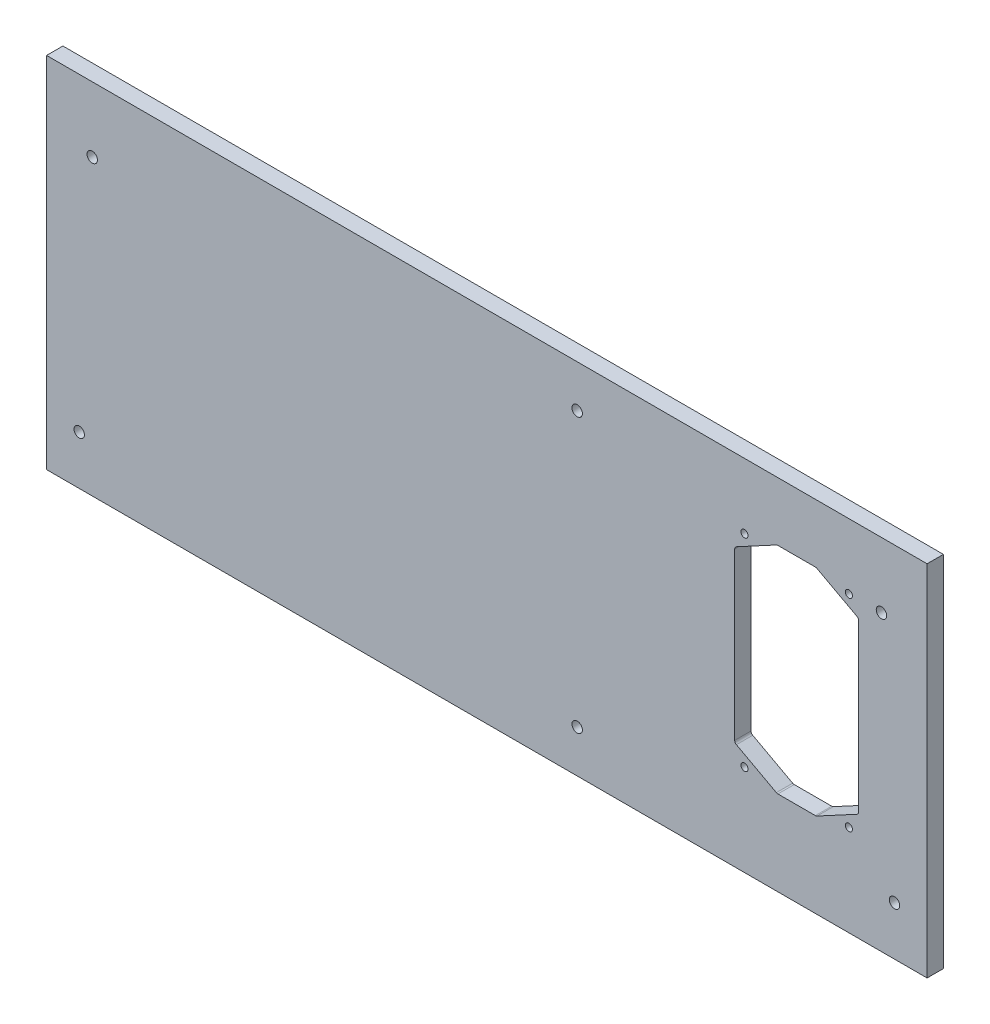
ISO-10303-21;
HEADER;
FILE_DESCRIPTION(('STEP AP214'),'2;1');
FILE_NAME('part.step','',(''),(''),'','','');
FILE_SCHEMA(('AUTOMOTIVE_DESIGN { 1 0 10303 214 1 1 1 1 }'));
ENDSEC;
DATA;
#1=APPLICATION_CONTEXT('core data for automotive mechanical design processes');
#2=APPLICATION_PROTOCOL_DEFINITION('international standard','automotive_design',2000,#1);
#3=PRODUCT_CONTEXT('',#1,'mechanical');
#4=PRODUCT('Part','Part','',(#3));
#5=PRODUCT_RELATED_PRODUCT_CATEGORY('part','',(#4));
#6=PRODUCT_DEFINITION_FORMATION('','',#4);
#7=PRODUCT_DEFINITION_CONTEXT('part definition',#1,'design');
#8=PRODUCT_DEFINITION('design','',#6,#7);
#9=PRODUCT_DEFINITION_SHAPE('','',#8);
#10=(LENGTH_UNIT() NAMED_UNIT(*) SI_UNIT(.MILLI.,.METRE.));
#11=(NAMED_UNIT(*) PLANE_ANGLE_UNIT() SI_UNIT($,.RADIAN.));
#12=(NAMED_UNIT(*) SI_UNIT($,.STERADIAN.) SOLID_ANGLE_UNIT());
#13=UNCERTAINTY_MEASURE_WITH_UNIT(LENGTH_MEASURE(1.E-05),#10,'distance_accuracy_value','');
#14=(GEOMETRIC_REPRESENTATION_CONTEXT(3) GLOBAL_UNCERTAINTY_ASSIGNED_CONTEXT((#13)) GLOBAL_UNIT_ASSIGNED_CONTEXT((#10,
#11,#12)) REPRESENTATION_CONTEXT('',''));
#15=CARTESIAN_POINT('',(0.,0.,0.));
#16=DIRECTION('',(0.,0.,1.));
#17=DIRECTION('',(1.,0.,0.));
#18=AXIS2_PLACEMENT_3D('',#15,#16,#17);
#19=CARTESIAN_POINT('',(-135.,-55.,2.5));
#20=DIRECTION('',(1.,0.,0.));
#21=DIRECTION('',(0.,0.,-1.));
#22=AXIS2_PLACEMENT_3D('',#19,#20,#21);
#23=PLANE('',#22);
#24=DIRECTION('',(0.,-1.,0.));
#25=VECTOR('',#24,1.);
#26=CARTESIAN_POINT('',(-135.,-55.,-2.5));
#27=LINE('',#26,#25);
#28=CARTESIAN_POINT('',(-135.,55.,-2.5));
#29=VERTEX_POINT('',#28);
#30=CARTESIAN_POINT('',(-135.,-55.,-2.5));
#31=VERTEX_POINT('',#30);
#32=EDGE_CURVE('E194',#29,#31,#27,.T.);
#33=ORIENTED_EDGE('',*,*,#32,.T.);
#34=DIRECTION('',(0.,0.,-1.));
#35=VECTOR('',#34,1.);
#36=CARTESIAN_POINT('',(-135.,-55.,2.5));
#37=LINE('',#36,#35);
#38=CARTESIAN_POINT('',(-135.,-55.,2.5));
#39=VERTEX_POINT('',#38);
#40=EDGE_CURVE('E175',#39,#31,#37,.T.);
#41=ORIENTED_EDGE('',*,*,#40,.F.);
#42=DIRECTION('',(0.,-1.,0.));
#43=VECTOR('',#42,1.);
#44=CARTESIAN_POINT('',(-135.,-55.,2.5));
#45=LINE('',#44,#43);
#46=CARTESIAN_POINT('',(-135.,55.,2.5));
#47=VERTEX_POINT('',#46);
#48=EDGE_CURVE('E182',#47,#39,#45,.T.);
#49=ORIENTED_EDGE('',*,*,#48,.F.);
#50=DIRECTION('',(0.,0.,-1.));
#51=VECTOR('',#50,1.);
#52=CARTESIAN_POINT('',(-135.,55.,2.5));
#53=LINE('',#52,#51);
#54=EDGE_CURVE('E321',#47,#29,#53,.T.);
#55=ORIENTED_EDGE('',*,*,#54,.T.);
#56=EDGE_LOOP('',(#33,#41,#49,#55));
#57=FACE_BOUND('',#56,.T.);
#58=ADVANCED_FACE('F33',(#57),#23,.F.);
#59=CARTESIAN_POINT('',(135.,-55.,2.5));
#60=DIRECTION('',(0.,1.,0.));
#61=DIRECTION('',(-1.,0.,0.));
#62=AXIS2_PLACEMENT_3D('',#59,#60,#61);
#63=PLANE('',#62);
#64=DIRECTION('',(1.,0.,0.));
#65=VECTOR('',#64,1.);
#66=CARTESIAN_POINT('',(135.,-55.,-2.5));
#67=LINE('',#66,#65);
#68=CARTESIAN_POINT('',(135.,-55.,-2.5));
#69=VERTEX_POINT('',#68);
#70=EDGE_CURVE('E295',#31,#69,#67,.T.);
#71=ORIENTED_EDGE('',*,*,#70,.T.);
#72=DIRECTION('',(0.,0.,-1.));
#73=VECTOR('',#72,1.);
#74=CARTESIAN_POINT('',(135.,-55.,2.5));
#75=LINE('',#74,#73);
#76=CARTESIAN_POINT('',(135.,-55.,2.5));
#77=VERTEX_POINT('',#76);
#78=EDGE_CURVE('E178',#77,#69,#75,.T.);
#79=ORIENTED_EDGE('',*,*,#78,.F.);
#80=DIRECTION('',(1.,0.,0.));
#81=VECTOR('',#80,1.);
#82=CARTESIAN_POINT('',(135.,-55.,2.5));
#83=LINE('',#82,#81);
#84=EDGE_CURVE('E171',#39,#77,#83,.T.);
#85=ORIENTED_EDGE('',*,*,#84,.F.);
#86=ORIENTED_EDGE('',*,*,#40,.T.);
#87=EDGE_LOOP('',(#71,#79,#85,#86));
#88=FACE_BOUND('',#87,.T.);
#89=ADVANCED_FACE('F173',(#88),#63,.F.);
#90=CARTESIAN_POINT('',(135.,-55.,2.5));
#91=DIRECTION('',(-1.,0.,0.));
#92=DIRECTION('',(0.,0.,1.));
#93=AXIS2_PLACEMENT_3D('',#90,#91,#92);
#94=PLANE('',#93);
#95=DIRECTION('',(0.,1.,0.));
#96=VECTOR('',#95,1.);
#97=CARTESIAN_POINT('',(135.,-55.,-2.5));
#98=LINE('',#97,#96);
#99=CARTESIAN_POINT('',(135.,55.,-2.5));
#100=VERTEX_POINT('',#99);
#101=EDGE_CURVE('E324',#69,#100,#98,.T.);
#102=ORIENTED_EDGE('',*,*,#101,.T.);
#103=DIRECTION('',(0.,0.,-1.));
#104=VECTOR('',#103,1.);
#105=CARTESIAN_POINT('',(135.,55.,2.5));
#106=LINE('',#105,#104);
#107=CARTESIAN_POINT('',(135.,55.,2.5));
#108=VERTEX_POINT('',#107);
#109=EDGE_CURVE('E199',#108,#100,#106,.T.);
#110=ORIENTED_EDGE('',*,*,#109,.F.);
#111=DIRECTION('',(0.,1.,0.));
#112=VECTOR('',#111,1.);
#113=CARTESIAN_POINT('',(135.,-55.,2.5));
#114=LINE('',#113,#112);
#115=EDGE_CURVE('E181',#77,#108,#114,.T.);
#116=ORIENTED_EDGE('',*,*,#115,.F.);
#117=ORIENTED_EDGE('',*,*,#78,.T.);
#118=EDGE_LOOP('',(#102,#110,#116,#117));
#119=FACE_BOUND('',#118,.T.);
#120=ADVANCED_FACE('F334',(#119),#94,.F.);
#121=CARTESIAN_POINT('',(135.,55.,2.5));
#122=DIRECTION('',(0.,-1.,0.));
#123=DIRECTION('',(1.,0.,0.));
#124=AXIS2_PLACEMENT_3D('',#121,#122,#123);
#125=PLANE('',#124);
#126=DIRECTION('',(-1.,0.,0.));
#127=VECTOR('',#126,1.);
#128=CARTESIAN_POINT('',(135.,55.,-2.5));
#129=LINE('',#128,#127);
#130=EDGE_CURVE('E191',#100,#29,#129,.T.);
#131=ORIENTED_EDGE('',*,*,#130,.T.);
#132=ORIENTED_EDGE('',*,*,#54,.F.);
#133=DIRECTION('',(-1.,0.,0.));
#134=VECTOR('',#133,1.);
#135=CARTESIAN_POINT('',(135.,55.,2.5));
#136=LINE('',#135,#134);
#137=EDGE_CURVE('E187',#108,#47,#136,.T.);
#138=ORIENTED_EDGE('',*,*,#137,.F.);
#139=ORIENTED_EDGE('',*,*,#109,.T.);
#140=EDGE_LOOP('',(#131,#132,#138,#139));
#141=FACE_BOUND('',#140,.T.);
#142=ADVANCED_FACE('F331',(#141),#125,.F.);
#143=CARTESIAN_POINT('',(0.,0.,2.5));
#144=DIRECTION('',(0.,0.,1.));
#145=DIRECTION('',(1.,0.,0.));
#146=AXIS2_PLACEMENT_3D('',#143,#144,#145);
#147=PLANE('',#146);
#148=CARTESIAN_POINT('',(27.7,42.,2.5));
#149=DIRECTION('',(0.,0.,-1.));
#150=DIRECTION('',(-1.,0.,0.));
#151=AXIS2_PLACEMENT_3D('',#148,#149,#150);
#152=CIRCLE('',#151,1.59999999999999);
#153=CARTESIAN_POINT('',(26.1,42.,2.5));
#154=VERTEX_POINT('',#153);
#155=EDGE_CURVE('E542',#154,#154,#152,.T.);
#156=ORIENTED_EDGE('',*,*,#155,.T.);
#157=EDGE_LOOP('',(#156));
#158=FACE_BOUND('',#157,.T.);
#159=CARTESIAN_POINT('',(27.7,-42.,2.5));
#160=DIRECTION('',(0.,0.,-1.));
#161=DIRECTION('',(-1.,0.,0.));
#162=AXIS2_PLACEMENT_3D('',#159,#160,#161);
#163=CIRCLE('',#162,1.59999999999999);
#164=CARTESIAN_POINT('',(26.1,-42.,2.5));
#165=VERTEX_POINT('',#164);
#166=EDGE_CURVE('E535',#165,#165,#163,.T.);
#167=ORIENTED_EDGE('',*,*,#166,.T.);
#168=EDGE_LOOP('',(#167));
#169=FACE_BOUND('',#168,.T.);
#170=CARTESIAN_POINT('',(121.,35.,2.5));
#171=DIRECTION('',(0.,0.,-1.));
#172=DIRECTION('',(-1.,0.,0.));
#173=AXIS2_PLACEMENT_3D('',#170,#171,#172);
#174=CIRCLE('',#173,1.59999999999999);
#175=CARTESIAN_POINT('',(119.4,35.,2.5));
#176=VERTEX_POINT('',#175);
#177=EDGE_CURVE('E528',#176,#176,#174,.T.);
#178=ORIENTED_EDGE('',*,*,#177,.T.);
#179=EDGE_LOOP('',(#178));
#180=FACE_BOUND('',#179,.T.);
#181=CARTESIAN_POINT('',(125.,-40.,2.5));
#182=DIRECTION('',(0.,0.,-1.));
#183=DIRECTION('',(-1.,0.,0.));
#184=AXIS2_PLACEMENT_3D('',#181,#182,#183);
#185=CIRCLE('',#184,1.59999999999999);
#186=CARTESIAN_POINT('',(123.4,-40.,2.5));
#187=VERTEX_POINT('',#186);
#188=EDGE_CURVE('E521',#187,#187,#185,.T.);
#189=ORIENTED_EDGE('',*,*,#188,.T.);
#190=EDGE_LOOP('',(#189));
#191=FACE_BOUND('',#190,.T.);
#192=CARTESIAN_POINT('',(-125.,-40.,2.5));
#193=DIRECTION('',(0.,0.,-1.));
#194=DIRECTION('',(-1.,0.,0.));
#195=AXIS2_PLACEMENT_3D('',#192,#193,#194);
#196=CIRCLE('',#195,1.59999999999999);
#197=CARTESIAN_POINT('',(-126.6,-40.,2.5));
#198=VERTEX_POINT('',#197);
#199=EDGE_CURVE('E514',#198,#198,#196,.T.);
#200=ORIENTED_EDGE('',*,*,#199,.T.);
#201=EDGE_LOOP('',(#200));
#202=FACE_BOUND('',#201,.T.);
#203=CARTESIAN_POINT('',(-121.,35.,2.5));
#204=DIRECTION('',(0.,0.,-1.));
#205=DIRECTION('',(-1.,0.,0.));
#206=AXIS2_PLACEMENT_3D('',#203,#204,#205);
#207=CIRCLE('',#206,1.59999999999999);
#208=CARTESIAN_POINT('',(-122.6,35.,2.5));
#209=VERTEX_POINT('',#208);
#210=EDGE_CURVE('E490',#209,#209,#207,.T.);
#211=ORIENTED_EDGE('',*,*,#210,.T.);
#212=EDGE_LOOP('',(#211));
#213=FACE_BOUND('',#212,.T.);
#214=CARTESIAN_POINT('',(79.,35.,2.5));
#215=DIRECTION('',(0.,0.,-1.));
#216=DIRECTION('',(-1.,0.,0.));
#217=AXIS2_PLACEMENT_3D('',#214,#215,#216);
#218=CIRCLE('',#217,1.10000000000004);
#219=CARTESIAN_POINT('',(77.9,35.,2.5));
#220=VERTEX_POINT('',#219);
#221=EDGE_CURVE('E305',#220,#220,#218,.T.);
#222=ORIENTED_EDGE('',*,*,#221,.T.);
#223=EDGE_LOOP('',(#222));
#224=FACE_BOUND('',#223,.T.);
#225=CARTESIAN_POINT('',(111.,35.,2.5));
#226=DIRECTION('',(0.,0.,-1.));
#227=DIRECTION('',(-1.,0.,0.));
#228=AXIS2_PLACEMENT_3D('',#225,#226,#227);
#229=CIRCLE('',#228,1.10000000000001);
#230=CARTESIAN_POINT('',(109.9,35.,2.5));
#231=VERTEX_POINT('',#230);
#232=EDGE_CURVE('E505',#231,#231,#229,.T.);
#233=ORIENTED_EDGE('',*,*,#232,.T.);
#234=EDGE_LOOP('',(#233));
#235=FACE_BOUND('',#234,.T.);
#236=CARTESIAN_POINT('',(111.,-27.,2.5));
#237=DIRECTION('',(0.,0.,-1.));
#238=DIRECTION('',(-1.,0.,0.));
#239=AXIS2_PLACEMENT_3D('',#236,#237,#238);
#240=CIRCLE('',#239,1.10000000000001);
#241=CARTESIAN_POINT('',(109.9,-27.,2.5));
#242=VERTEX_POINT('',#241);
#243=EDGE_CURVE('E501',#242,#242,#240,.T.);
#244=ORIENTED_EDGE('',*,*,#243,.T.);
#245=EDGE_LOOP('',(#244));
#246=FACE_BOUND('',#245,.T.);
#247=CARTESIAN_POINT('',(79.,-27.,2.5));
#248=DIRECTION('',(0.,0.,-1.));
#249=DIRECTION('',(-1.,0.,0.));
#250=AXIS2_PLACEMENT_3D('',#247,#248,#249);
#251=CIRCLE('',#250,1.10000000000001);
#252=CARTESIAN_POINT('',(77.9,-27.,2.5));
#253=VERTEX_POINT('',#252);
#254=EDGE_CURVE('E489',#253,#253,#251,.T.);
#255=ORIENTED_EDGE('',*,*,#254,.T.);
#256=EDGE_LOOP('',(#255));
#257=FACE_BOUND('',#256,.T.);
#258=DIRECTION('',(0.,1.,0.));
#259=VECTOR('',#258,1.);
#260=CARTESIAN_POINT('',(76.,-22.,2.5));
#261=LINE('',#260,#259);
#262=CARTESIAN_POINT('',(76.,-21.4027059184436,2.5));
#263=VERTEX_POINT('',#262);
#264=CARTESIAN_POINT('',(76.,29.4027059184436,2.5));
#265=VERTEX_POINT('',#264);
#266=EDGE_CURVE('E288',#263,#265,#261,.T.);
#267=ORIENTED_EDGE('',*,*,#266,.T.);
#268=CARTESIAN_POINT('',(77.,29.4027059184436,2.5));
#269=DIRECTION('',(0.,0.,1.));
#270=DIRECTION('',(1.,0.,0.));
#271=AXIS2_PLACEMENT_3D('',#268,#269,#270);
#272=CIRCLE('',#271,1.);
#273=CARTESIAN_POINT('',(76.525900176965,30.2831770183658,2.5));
#274=VERTEX_POINT('',#273);
#275=EDGE_CURVE('E241',#265,#274,#272,.F.);
#276=ORIENTED_EDGE('',*,*,#275,.T.);
#277=DIRECTION('',(0.880471099922175,0.474099823035017,0.));
#278=VECTOR('',#277,1.);
#279=CARTESIAN_POINT('',(76.,30.,2.5));
#280=LINE('',#279,#278);
#281=CARTESIAN_POINT('',(88.7780177569983,36.8804710999222,2.5));
#282=VERTEX_POINT('',#281);
#283=EDGE_CURVE('E318',#274,#282,#280,.T.);
#284=ORIENTED_EDGE('',*,*,#283,.T.);
#285=CARTESIAN_POINT('',(89.2521175800333,36.,2.5));
#286=DIRECTION('',(0.,0.,1.));
#287=DIRECTION('',(1.,0.,0.));
#288=AXIS2_PLACEMENT_3D('',#285,#286,#287);
#289=CIRCLE('',#288,1.);
#290=CARTESIAN_POINT('',(89.2521175800333,37.,2.5));
#291=VERTEX_POINT('',#290);
#292=EDGE_CURVE('E55',#282,#291,#289,.F.);
#293=ORIENTED_EDGE('',*,*,#292,.T.);
#294=DIRECTION('',(1.,0.,0.));
#295=VECTOR('',#294,1.);
#296=CARTESIAN_POINT('',(89.,37.,2.5));
#297=LINE('',#296,#295);
#298=CARTESIAN_POINT('',(100.747882419967,37.,2.5));
#299=VERTEX_POINT('',#298);
#300=EDGE_CURVE('E382',#291,#299,#297,.T.);
#301=ORIENTED_EDGE('',*,*,#300,.T.);
#302=CARTESIAN_POINT('',(100.747882419967,36.,2.5));
#303=DIRECTION('',(0.,0.,1.));
#304=DIRECTION('',(1.,0.,0.));
#305=AXIS2_PLACEMENT_3D('',#302,#303,#304);
#306=CIRCLE('',#305,1.);
#307=CARTESIAN_POINT('',(101.221982243002,36.8804710999222,2.5));
#308=VERTEX_POINT('',#307);
#309=EDGE_CURVE('E261',#299,#308,#306,.F.);
#310=ORIENTED_EDGE('',*,*,#309,.T.);
#311=DIRECTION('',(0.880471099922175,-0.474099823035018,0.));
#312=VECTOR('',#311,1.);
#313=CARTESIAN_POINT('',(101.,37.,2.5));
#314=LINE('',#313,#312);
#315=CARTESIAN_POINT('',(113.474099823035,30.2831770183657,2.5));
#316=VERTEX_POINT('',#315);
#317=EDGE_CURVE('E392',#308,#316,#314,.T.);
#318=ORIENTED_EDGE('',*,*,#317,.T.);
#319=CARTESIAN_POINT('',(113.,29.4027059184436,2.5));
#320=DIRECTION('',(0.,0.,1.));
#321=DIRECTION('',(1.,0.,0.));
#322=AXIS2_PLACEMENT_3D('',#319,#320,#321);
#323=CIRCLE('',#322,1.);
#324=CARTESIAN_POINT('',(114.,29.4027059184436,2.5));
#325=VERTEX_POINT('',#324);
#326=EDGE_CURVE('E257',#316,#325,#323,.F.);
#327=ORIENTED_EDGE('',*,*,#326,.T.);
#328=DIRECTION('',(0.,-1.,0.));
#329=VECTOR('',#328,1.);
#330=CARTESIAN_POINT('',(114.,-22.,2.5));
#331=LINE('',#330,#329);
#332=CARTESIAN_POINT('',(114.,-21.4027059184436,2.5));
#333=VERTEX_POINT('',#332);
#334=EDGE_CURVE('E394',#325,#333,#331,.T.);
#335=ORIENTED_EDGE('',*,*,#334,.T.);
#336=CARTESIAN_POINT('',(113.,-21.4027059184436,2.5));
#337=DIRECTION('',(0.,0.,1.));
#338=DIRECTION('',(1.,0.,0.));
#339=AXIS2_PLACEMENT_3D('',#336,#337,#338);
#340=CIRCLE('',#339,1.);
#341=CARTESIAN_POINT('',(113.474099823035,-22.2831770183658,2.5));
#342=VERTEX_POINT('',#341);
#343=EDGE_CURVE('E253',#333,#342,#340,.F.);
#344=ORIENTED_EDGE('',*,*,#343,.T.);
#345=DIRECTION('',(-0.880471099922175,-0.474099823035018,0.));
#346=VECTOR('',#345,1.);
#347=CARTESIAN_POINT('',(101.,-29.,2.5));
#348=LINE('',#347,#346);
#349=CARTESIAN_POINT('',(101.221982243002,-28.8804710999222,2.5));
#350=VERTEX_POINT('',#349);
#351=EDGE_CURVE('E397',#342,#350,#348,.T.);
#352=ORIENTED_EDGE('',*,*,#351,.T.);
#353=CARTESIAN_POINT('',(100.747882419967,-28.,2.5));
#354=DIRECTION('',(0.,0.,1.));
#355=DIRECTION('',(1.,0.,0.));
#356=AXIS2_PLACEMENT_3D('',#353,#354,#355);
#357=CIRCLE('',#356,1.);
#358=CARTESIAN_POINT('',(100.747882419967,-29.,2.5));
#359=VERTEX_POINT('',#358);
#360=EDGE_CURVE('E249',#350,#359,#357,.F.);
#361=ORIENTED_EDGE('',*,*,#360,.T.);
#362=DIRECTION('',(-1.,0.,0.));
#363=VECTOR('',#362,1.);
#364=CARTESIAN_POINT('',(89.,-29.,2.5));
#365=LINE('',#364,#363);
#366=CARTESIAN_POINT('',(89.2521175800333,-29.,2.5));
#367=VERTEX_POINT('',#366);
#368=EDGE_CURVE('E297',#359,#367,#365,.T.);
#369=ORIENTED_EDGE('',*,*,#368,.T.);
#370=CARTESIAN_POINT('',(89.2521175800333,-28.,2.5));
#371=DIRECTION('',(0.,0.,1.));
#372=DIRECTION('',(1.,0.,0.));
#373=AXIS2_PLACEMENT_3D('',#370,#371,#372);
#374=CIRCLE('',#373,1.);
#375=CARTESIAN_POINT('',(88.7780177569983,-28.8804710999222,2.5));
#376=VERTEX_POINT('',#375);
#377=EDGE_CURVE('E245',#367,#376,#374,.F.);
#378=ORIENTED_EDGE('',*,*,#377,.T.);
#379=DIRECTION('',(-0.880471099922175,0.474099823035017,0.));
#380=VECTOR('',#379,1.);
#381=CARTESIAN_POINT('',(76.,-22.,2.5));
#382=LINE('',#381,#380);
#383=CARTESIAN_POINT('',(76.525900176965,-22.2831770183658,2.5));
#384=VERTEX_POINT('',#383);
#385=EDGE_CURVE('E290',#376,#384,#382,.T.);
#386=ORIENTED_EDGE('',*,*,#385,.T.);
#387=CARTESIAN_POINT('',(77.,-21.4027059184436,2.5));
#388=DIRECTION('',(0.,0.,1.));
#389=DIRECTION('',(1.,0.,0.));
#390=AXIS2_PLACEMENT_3D('',#387,#388,#389);
#391=CIRCLE('',#390,1.);
#392=EDGE_CURVE('E11',#384,#263,#391,.F.);
#393=ORIENTED_EDGE('',*,*,#392,.T.);
#394=EDGE_LOOP('',(#267,#276,#284,#293,#301,#310,#318,#327,#335,#344,#352,#361,#369,#378,#386,#393));
#395=FACE_BOUND('',#394,.T.);
#396=ORIENTED_EDGE('',*,*,#48,.T.);
#397=ORIENTED_EDGE('',*,*,#84,.T.);
#398=ORIENTED_EDGE('',*,*,#115,.T.);
#399=ORIENTED_EDGE('',*,*,#137,.T.);
#400=EDGE_LOOP('',(#396,#397,#398,#399));
#401=FACE_BOUND('',#400,.T.);
#402=ADVANCED_FACE('F185',(#158,#169,#180,#191,#202,#213,#224,#235,#246,#257,#395,#401),#147,.T.);
#403=CARTESIAN_POINT('',(0.,0.,-2.5));
#404=DIRECTION('',(0.,0.,1.));
#405=DIRECTION('',(1.,0.,0.));
#406=AXIS2_PLACEMENT_3D('',#403,#404,#405);
#407=PLANE('',#406);
#408=CARTESIAN_POINT('',(27.7,42.,-2.5));
#409=DIRECTION('',(0.,0.,-1.));
#410=DIRECTION('',(-1.,0.,0.));
#411=AXIS2_PLACEMENT_3D('',#408,#409,#410);
#412=CIRCLE('',#411,3.25);
#413=CARTESIAN_POINT('',(24.45,42.,-2.5));
#414=VERTEX_POINT('',#413);
#415=EDGE_CURVE('E452',#414,#414,#412,.T.);
#416=ORIENTED_EDGE('',*,*,#415,.F.);
#417=EDGE_LOOP('',(#416));
#418=FACE_BOUND('',#417,.T.);
#419=CARTESIAN_POINT('',(27.7,-42.,-2.5));
#420=DIRECTION('',(0.,0.,-1.));
#421=DIRECTION('',(-1.,0.,0.));
#422=AXIS2_PLACEMENT_3D('',#419,#420,#421);
#423=CIRCLE('',#422,3.25);
#424=CARTESIAN_POINT('',(24.45,-42.,-2.5));
#425=VERTEX_POINT('',#424);
#426=EDGE_CURVE('E456',#425,#425,#423,.T.);
#427=ORIENTED_EDGE('',*,*,#426,.F.);
#428=EDGE_LOOP('',(#427));
#429=FACE_BOUND('',#428,.T.);
#430=CARTESIAN_POINT('',(121.,35.,-2.5));
#431=DIRECTION('',(0.,0.,-1.));
#432=DIRECTION('',(-1.,0.,0.));
#433=AXIS2_PLACEMENT_3D('',#430,#431,#432);
#434=CIRCLE('',#433,3.25);
#435=CARTESIAN_POINT('',(117.75,35.,-2.5));
#436=VERTEX_POINT('',#435);
#437=EDGE_CURVE('E460',#436,#436,#434,.T.);
#438=ORIENTED_EDGE('',*,*,#437,.F.);
#439=EDGE_LOOP('',(#438));
#440=FACE_BOUND('',#439,.T.);
#441=CARTESIAN_POINT('',(125.,-40.,-2.5));
#442=DIRECTION('',(0.,0.,-1.));
#443=DIRECTION('',(-1.,0.,0.));
#444=AXIS2_PLACEMENT_3D('',#441,#442,#443);
#445=CIRCLE('',#444,3.25);
#446=CARTESIAN_POINT('',(121.75,-40.,-2.5));
#447=VERTEX_POINT('',#446);
#448=EDGE_CURVE('E464',#447,#447,#445,.T.);
#449=ORIENTED_EDGE('',*,*,#448,.F.);
#450=EDGE_LOOP('',(#449));
#451=FACE_BOUND('',#450,.T.);
#452=CARTESIAN_POINT('',(-125.,-40.,-2.5));
#453=DIRECTION('',(0.,0.,-1.));
#454=DIRECTION('',(-1.,0.,0.));
#455=AXIS2_PLACEMENT_3D('',#452,#453,#454);
#456=CIRCLE('',#455,3.25);
#457=CARTESIAN_POINT('',(-128.25,-40.,-2.5));
#458=VERTEX_POINT('',#457);
#459=EDGE_CURVE('E468',#458,#458,#456,.T.);
#460=ORIENTED_EDGE('',*,*,#459,.F.);
#461=EDGE_LOOP('',(#460));
#462=FACE_BOUND('',#461,.T.);
#463=CARTESIAN_POINT('',(-121.,35.,-2.5));
#464=DIRECTION('',(0.,0.,-1.));
#465=DIRECTION('',(-1.,0.,0.));
#466=AXIS2_PLACEMENT_3D('',#463,#464,#465);
#467=CIRCLE('',#466,3.25);
#468=CARTESIAN_POINT('',(-124.25,35.,-2.5));
#469=VERTEX_POINT('',#468);
#470=EDGE_CURVE('E472',#469,#469,#467,.T.);
#471=ORIENTED_EDGE('',*,*,#470,.F.);
#472=EDGE_LOOP('',(#471));
#473=FACE_BOUND('',#472,.T.);
#474=CARTESIAN_POINT('',(79.,35.,-2.5));
#475=DIRECTION('',(0.,0.,-1.));
#476=DIRECTION('',(-1.,0.,0.));
#477=AXIS2_PLACEMENT_3D('',#474,#475,#476);
#478=CIRCLE('',#477,1.10000000000004);
#479=CARTESIAN_POINT('',(77.9,35.,-2.5));
#480=VERTEX_POINT('',#479);
#481=EDGE_CURVE('E476',#480,#480,#478,.T.);
#482=ORIENTED_EDGE('',*,*,#481,.F.);
#483=EDGE_LOOP('',(#482));
#484=FACE_BOUND('',#483,.T.);
#485=CARTESIAN_POINT('',(111.,35.,-2.5));
#486=DIRECTION('',(0.,0.,-1.));
#487=DIRECTION('',(-1.,0.,0.));
#488=AXIS2_PLACEMENT_3D('',#485,#486,#487);
#489=CIRCLE('',#488,1.10000000000001);
#490=CARTESIAN_POINT('',(109.9,35.,-2.5));
#491=VERTEX_POINT('',#490);
#492=EDGE_CURVE('E480',#491,#491,#489,.T.);
#493=ORIENTED_EDGE('',*,*,#492,.F.);
#494=EDGE_LOOP('',(#493));
#495=FACE_BOUND('',#494,.T.);
#496=CARTESIAN_POINT('',(111.,-27.,-2.5));
#497=DIRECTION('',(0.,0.,-1.));
#498=DIRECTION('',(-1.,0.,0.));
#499=AXIS2_PLACEMENT_3D('',#496,#497,#498);
#500=CIRCLE('',#499,1.10000000000001);
#501=CARTESIAN_POINT('',(109.9,-27.,-2.5));
#502=VERTEX_POINT('',#501);
#503=EDGE_CURVE('E484',#502,#502,#500,.T.);
#504=ORIENTED_EDGE('',*,*,#503,.F.);
#505=EDGE_LOOP('',(#504));
#506=FACE_BOUND('',#505,.T.);
#507=CARTESIAN_POINT('',(79.,-27.,-2.5));
#508=DIRECTION('',(0.,0.,-1.));
#509=DIRECTION('',(-1.,0.,0.));
#510=AXIS2_PLACEMENT_3D('',#507,#508,#509);
#511=CIRCLE('',#510,1.10000000000001);
#512=CARTESIAN_POINT('',(77.9,-27.,-2.5));
#513=VERTEX_POINT('',#512);
#514=EDGE_CURVE('E487',#513,#513,#511,.T.);
#515=ORIENTED_EDGE('',*,*,#514,.F.);
#516=EDGE_LOOP('',(#515));
#517=FACE_BOUND('',#516,.T.);
#518=DIRECTION('',(1.,0.,0.));
#519=VECTOR('',#518,1.);
#520=CARTESIAN_POINT('',(89.,37.,-2.5));
#521=LINE('',#520,#519);
#522=CARTESIAN_POINT('',(89.2521175800333,37.,-2.5));
#523=VERTEX_POINT('',#522);
#524=CARTESIAN_POINT('',(100.747882419967,37.,-2.5));
#525=VERTEX_POINT('',#524);
#526=EDGE_CURVE('E304',#523,#525,#521,.T.);
#527=ORIENTED_EDGE('',*,*,#526,.F.);
#528=CARTESIAN_POINT('',(89.2521175800333,36.,-2.5));
#529=DIRECTION('',(0.,0.,1.));
#530=DIRECTION('',(1.,0.,0.));
#531=AXIS2_PLACEMENT_3D('',#528,#529,#530);
#532=CIRCLE('',#531,1.);
#533=CARTESIAN_POINT('',(88.7780177569983,36.8804710999222,-2.5));
#534=VERTEX_POINT('',#533);
#535=EDGE_CURVE('E263',#523,#534,#532,.T.);
#536=ORIENTED_EDGE('',*,*,#535,.T.);
#537=DIRECTION('',(0.880471099922175,0.474099823035017,0.));
#538=VECTOR('',#537,1.);
#539=CARTESIAN_POINT('',(76.,30.,-2.5));
#540=LINE('',#539,#538);
#541=CARTESIAN_POINT('',(76.525900176965,30.2831770183658,-2.5));
#542=VERTEX_POINT('',#541);
#543=EDGE_CURVE('E301',#542,#534,#540,.T.);
#544=ORIENTED_EDGE('',*,*,#543,.F.);
#545=CARTESIAN_POINT('',(77.,29.4027059184436,-2.5));
#546=DIRECTION('',(0.,0.,1.));
#547=DIRECTION('',(1.,0.,0.));
#548=AXIS2_PLACEMENT_3D('',#545,#546,#547);
#549=CIRCLE('',#548,1.);
#550=CARTESIAN_POINT('',(76.,29.4027059184436,-2.5));
#551=VERTEX_POINT('',#550);
#552=EDGE_CURVE('E239',#542,#551,#549,.T.);
#553=ORIENTED_EDGE('',*,*,#552,.T.);
#554=DIRECTION('',(0.,1.,0.));
#555=VECTOR('',#554,1.);
#556=CARTESIAN_POINT('',(76.,-22.,-2.5));
#557=LINE('',#556,#555);
#558=CARTESIAN_POINT('',(76.,-21.4027059184436,-2.5));
#559=VERTEX_POINT('',#558);
#560=EDGE_CURVE('E274',#559,#551,#557,.T.);
#561=ORIENTED_EDGE('',*,*,#560,.F.);
#562=CARTESIAN_POINT('',(77.,-21.4027059184436,-2.5));
#563=DIRECTION('',(0.,0.,1.));
#564=DIRECTION('',(1.,0.,0.));
#565=AXIS2_PLACEMENT_3D('',#562,#563,#564);
#566=CIRCLE('',#565,1.);
#567=CARTESIAN_POINT('',(76.525900176965,-22.2831770183658,-2.5));
#568=VERTEX_POINT('',#567);
#569=EDGE_CURVE('E41',#559,#568,#566,.T.);
#570=ORIENTED_EDGE('',*,*,#569,.T.);
#571=DIRECTION('',(-0.880471099922175,0.474099823035017,0.));
#572=VECTOR('',#571,1.);
#573=CARTESIAN_POINT('',(76.,-22.,-2.5));
#574=LINE('',#573,#572);
#575=CARTESIAN_POINT('',(88.7780177569983,-28.8804710999222,-2.5));
#576=VERTEX_POINT('',#575);
#577=EDGE_CURVE('E272',#576,#568,#574,.T.);
#578=ORIENTED_EDGE('',*,*,#577,.F.);
#579=CARTESIAN_POINT('',(89.2521175800333,-28.,-2.5));
#580=DIRECTION('',(0.,0.,1.));
#581=DIRECTION('',(1.,0.,0.));
#582=AXIS2_PLACEMENT_3D('',#579,#580,#581);
#583=CIRCLE('',#582,1.);
#584=CARTESIAN_POINT('',(89.2521175800333,-29.,-2.5));
#585=VERTEX_POINT('',#584);
#586=EDGE_CURVE('E243',#576,#585,#583,.T.);
#587=ORIENTED_EDGE('',*,*,#586,.T.);
#588=DIRECTION('',(-1.,0.,0.));
#589=VECTOR('',#588,1.);
#590=CARTESIAN_POINT('',(89.,-29.,-2.5));
#591=LINE('',#590,#589);
#592=CARTESIAN_POINT('',(100.747882419967,-29.,-2.5));
#593=VERTEX_POINT('',#592);
#594=EDGE_CURVE('E283',#593,#585,#591,.T.);
#595=ORIENTED_EDGE('',*,*,#594,.F.);
#596=CARTESIAN_POINT('',(100.747882419967,-28.,-2.5));
#597=DIRECTION('',(0.,0.,1.));
#598=DIRECTION('',(1.,0.,0.));
#599=AXIS2_PLACEMENT_3D('',#596,#597,#598);
#600=CIRCLE('',#599,1.);
#601=CARTESIAN_POINT('',(101.221982243002,-28.8804710999222,-2.5));
#602=VERTEX_POINT('',#601);
#603=EDGE_CURVE('E247',#593,#602,#600,.T.);
#604=ORIENTED_EDGE('',*,*,#603,.T.);
#605=DIRECTION('',(-0.880471099922175,-0.474099823035018,0.));
#606=VECTOR('',#605,1.);
#607=CARTESIAN_POINT('',(101.,-29.,-2.5));
#608=LINE('',#607,#606);
#609=CARTESIAN_POINT('',(113.474099823035,-22.2831770183658,-2.5));
#610=VERTEX_POINT('',#609);
#611=EDGE_CURVE('E313',#610,#602,#608,.T.);
#612=ORIENTED_EDGE('',*,*,#611,.F.);
#613=CARTESIAN_POINT('',(113.,-21.4027059184436,-2.5));
#614=DIRECTION('',(0.,0.,1.));
#615=DIRECTION('',(1.,0.,0.));
#616=AXIS2_PLACEMENT_3D('',#613,#614,#615);
#617=CIRCLE('',#616,1.);
#618=CARTESIAN_POINT('',(114.,-21.4027059184436,-2.5));
#619=VERTEX_POINT('',#618);
#620=EDGE_CURVE('E251',#610,#619,#617,.T.);
#621=ORIENTED_EDGE('',*,*,#620,.T.);
#622=DIRECTION('',(0.,-1.,0.));
#623=VECTOR('',#622,1.);
#624=CARTESIAN_POINT('',(114.,-22.,-2.5));
#625=LINE('',#624,#623);
#626=CARTESIAN_POINT('',(114.,29.4027059184436,-2.5));
#627=VERTEX_POINT('',#626);
#628=EDGE_CURVE('E310',#627,#619,#625,.T.);
#629=ORIENTED_EDGE('',*,*,#628,.F.);
#630=CARTESIAN_POINT('',(113.,29.4027059184436,-2.5));
#631=DIRECTION('',(0.,0.,1.));
#632=DIRECTION('',(1.,0.,0.));
#633=AXIS2_PLACEMENT_3D('',#630,#631,#632);
#634=CIRCLE('',#633,1.);
#635=CARTESIAN_POINT('',(113.474099823035,30.2831770183657,-2.5));
#636=VERTEX_POINT('',#635);
#637=EDGE_CURVE('E255',#627,#636,#634,.T.);
#638=ORIENTED_EDGE('',*,*,#637,.T.);
#639=DIRECTION('',(0.880471099922175,-0.474099823035018,0.));
#640=VECTOR('',#639,1.);
#641=CARTESIAN_POINT('',(101.,37.,-2.5));
#642=LINE('',#641,#640);
#643=CARTESIAN_POINT('',(101.221982243002,36.8804710999222,-2.5));
#644=VERTEX_POINT('',#643);
#645=EDGE_CURVE('E307',#644,#636,#642,.T.);
#646=ORIENTED_EDGE('',*,*,#645,.F.);
#647=CARTESIAN_POINT('',(100.747882419967,36.,-2.5));
#648=DIRECTION('',(0.,0.,1.));
#649=DIRECTION('',(1.,0.,0.));
#650=AXIS2_PLACEMENT_3D('',#647,#648,#649);
#651=CIRCLE('',#650,1.);
#652=EDGE_CURVE('E259',#644,#525,#651,.T.);
#653=ORIENTED_EDGE('',*,*,#652,.T.);
#654=EDGE_LOOP('',(#527,#536,#544,#553,#561,#570,#578,#587,#595,#604,#612,#621,#629,#638,#646,#653));
#655=FACE_BOUND('',#654,.T.);
#656=ORIENTED_EDGE('',*,*,#32,.F.);
#657=ORIENTED_EDGE('',*,*,#130,.F.);
#658=ORIENTED_EDGE('',*,*,#101,.F.);
#659=ORIENTED_EDGE('',*,*,#70,.F.);
#660=EDGE_LOOP('',(#656,#657,#658,#659));
#661=FACE_BOUND('',#660,.T.);
#662=ADVANCED_FACE('F270',(#418,#429,#440,#451,#462,#473,#484,#495,#506,#517,#655,#661),#407,.F.);
#663=CARTESIAN_POINT('',(76.,30.,2.5));
#664=DIRECTION('',(-0.474099823035017,0.880471099922175,0.));
#665=DIRECTION('',(-0.880471099922175,-0.474099823035018,0.));
#666=AXIS2_PLACEMENT_3D('',#663,#664,#665);
#667=PLANE('',#666);
#668=ORIENTED_EDGE('',*,*,#283,.F.);
#669=DIRECTION('',(0.,0.,-1.));
#670=VECTOR('',#669,1.);
#671=CARTESIAN_POINT('',(76.525900176965,30.2831770183658,-2.5));
#672=LINE('',#671,#670);
#673=EDGE_CURVE('E197',#274,#542,#672,.T.);
#674=ORIENTED_EDGE('',*,*,#673,.T.);
#675=ORIENTED_EDGE('',*,*,#543,.T.);
#676=DIRECTION('',(0.,0.,-1.));
#677=VECTOR('',#676,1.);
#678=CARTESIAN_POINT('',(88.7780177569983,36.8804710999222,2.5));
#679=LINE('',#678,#677);
#680=EDGE_CURVE('E195',#534,#282,#679,.F.);
#681=ORIENTED_EDGE('',*,*,#680,.T.);
#682=EDGE_LOOP('',(#668,#674,#675,#681));
#683=FACE_BOUND('',#682,.T.);
#684=ADVANCED_FACE('F438',(#683),#667,.F.);
#685=CARTESIAN_POINT('',(76.,-22.,2.5));
#686=DIRECTION('',(-1.,0.,0.));
#687=DIRECTION('',(0.,0.,1.));
#688=AXIS2_PLACEMENT_3D('',#685,#686,#687);
#689=PLANE('',#688);
#690=ORIENTED_EDGE('',*,*,#560,.T.);
#691=DIRECTION('',(0.,0.,-1.));
#692=VECTOR('',#691,1.);
#693=CARTESIAN_POINT('',(76.,29.4027059184436,2.5));
#694=LINE('',#693,#692);
#695=EDGE_CURVE('E208',#551,#265,#694,.F.);
#696=ORIENTED_EDGE('',*,*,#695,.T.);
#697=ORIENTED_EDGE('',*,*,#266,.F.);
#698=DIRECTION('',(0.,0.,-1.));
#699=VECTOR('',#698,1.);
#700=CARTESIAN_POINT('',(76.,-21.4027059184436,-2.5));
#701=LINE('',#700,#699);
#702=EDGE_CURVE('E205',#263,#559,#701,.T.);
#703=ORIENTED_EDGE('',*,*,#702,.T.);
#704=EDGE_LOOP('',(#690,#696,#697,#703));
#705=FACE_BOUND('',#704,.T.);
#706=ADVANCED_FACE('F292',(#705),#689,.F.);
#707=CARTESIAN_POINT('',(76.,-22.,2.5));
#708=DIRECTION('',(-0.474099823035017,-0.880471099922175,0.));
#709=DIRECTION('',(0.880471099922175,-0.474099823035018,0.));
#710=AXIS2_PLACEMENT_3D('',#707,#708,#709);
#711=PLANE('',#710);
#712=ORIENTED_EDGE('',*,*,#385,.F.);
#713=DIRECTION('',(0.,0.,-1.));
#714=VECTOR('',#713,1.);
#715=CARTESIAN_POINT('',(88.7780177569983,-28.8804710999222,-2.5));
#716=LINE('',#715,#714);
#717=EDGE_CURVE('E212',#376,#576,#716,.T.);
#718=ORIENTED_EDGE('',*,*,#717,.T.);
#719=ORIENTED_EDGE('',*,*,#577,.T.);
#720=DIRECTION('',(0.,0.,-1.));
#721=VECTOR('',#720,1.);
#722=CARTESIAN_POINT('',(76.525900176965,-22.2831770183658,2.5));
#723=LINE('',#722,#721);
#724=EDGE_CURVE('E210',#568,#384,#723,.F.);
#725=ORIENTED_EDGE('',*,*,#724,.T.);
#726=EDGE_LOOP('',(#712,#718,#719,#725));
#727=FACE_BOUND('',#726,.T.);
#728=ADVANCED_FACE('F280',(#727),#711,.F.);
#729=CARTESIAN_POINT('',(89.,-29.,2.5));
#730=DIRECTION('',(0.,-1.,0.));
#731=DIRECTION('',(1.,0.,0.));
#732=AXIS2_PLACEMENT_3D('',#729,#730,#731);
#733=PLANE('',#732);
#734=ORIENTED_EDGE('',*,*,#594,.T.);
#735=DIRECTION('',(0.,0.,-1.));
#736=VECTOR('',#735,1.);
#737=CARTESIAN_POINT('',(89.2521175800333,-29.,2.5));
#738=LINE('',#737,#736);
#739=EDGE_CURVE('E218',#585,#367,#738,.F.);
#740=ORIENTED_EDGE('',*,*,#739,.T.);
#741=ORIENTED_EDGE('',*,*,#368,.F.);
#742=DIRECTION('',(0.,0.,-1.));
#743=VECTOR('',#742,1.);
#744=CARTESIAN_POINT('',(100.747882419967,-29.,-2.5));
#745=LINE('',#744,#743);
#746=EDGE_CURVE('E215',#359,#593,#745,.T.);
#747=ORIENTED_EDGE('',*,*,#746,.T.);
#748=EDGE_LOOP('',(#734,#740,#741,#747));
#749=FACE_BOUND('',#748,.T.);
#750=ADVANCED_FACE('F411',(#749),#733,.F.);
#751=CARTESIAN_POINT('',(101.,-29.,2.5));
#752=DIRECTION('',(0.474099823035018,-0.880471099922175,0.));
#753=DIRECTION('',(0.880471099922175,0.474099823035018,0.));
#754=AXIS2_PLACEMENT_3D('',#751,#752,#753);
#755=PLANE('',#754);
#756=ORIENTED_EDGE('',*,*,#611,.T.);
#757=DIRECTION('',(0.,0.,-1.));
#758=VECTOR('',#757,1.);
#759=CARTESIAN_POINT('',(101.221982243002,-28.8804710999222,2.5));
#760=LINE('',#759,#758);
#761=EDGE_CURVE('E223',#602,#350,#760,.F.);
#762=ORIENTED_EDGE('',*,*,#761,.T.);
#763=ORIENTED_EDGE('',*,*,#351,.F.);
#764=DIRECTION('',(0.,0.,-1.));
#765=VECTOR('',#764,1.);
#766=CARTESIAN_POINT('',(113.474099823035,-22.2831770183658,-2.5));
#767=LINE('',#766,#765);
#768=EDGE_CURVE('E220',#342,#610,#767,.T.);
#769=ORIENTED_EDGE('',*,*,#768,.T.);
#770=EDGE_LOOP('',(#756,#762,#763,#769));
#771=FACE_BOUND('',#770,.T.);
#772=ADVANCED_FACE('F415',(#771),#755,.F.);
#773=CARTESIAN_POINT('',(114.,-22.,2.5));
#774=DIRECTION('',(1.,0.,0.));
#775=DIRECTION('',(0.,0.,-1.));
#776=AXIS2_PLACEMENT_3D('',#773,#774,#775);
#777=PLANE('',#776);
#778=ORIENTED_EDGE('',*,*,#628,.T.);
#779=DIRECTION('',(0.,0.,-1.));
#780=VECTOR('',#779,1.);
#781=CARTESIAN_POINT('',(114.,-21.4027059184436,2.5));
#782=LINE('',#781,#780);
#783=EDGE_CURVE('E228',#619,#333,#782,.F.);
#784=ORIENTED_EDGE('',*,*,#783,.T.);
#785=ORIENTED_EDGE('',*,*,#334,.F.);
#786=DIRECTION('',(0.,0.,-1.));
#787=VECTOR('',#786,1.);
#788=CARTESIAN_POINT('',(114.,29.4027059184436,-2.5));
#789=LINE('',#788,#787);
#790=EDGE_CURVE('E225',#325,#627,#789,.T.);
#791=ORIENTED_EDGE('',*,*,#790,.T.);
#792=EDGE_LOOP('',(#778,#784,#785,#791));
#793=FACE_BOUND('',#792,.T.);
#794=ADVANCED_FACE('F422',(#793),#777,.F.);
#795=CARTESIAN_POINT('',(101.,37.,2.5));
#796=DIRECTION('',(0.474099823035018,0.880471099922175,0.));
#797=DIRECTION('',(-0.880471099922175,0.474099823035018,0.));
#798=AXIS2_PLACEMENT_3D('',#795,#796,#797);
#799=PLANE('',#798);
#800=ORIENTED_EDGE('',*,*,#645,.T.);
#801=DIRECTION('',(0.,0.,-1.));
#802=VECTOR('',#801,1.);
#803=CARTESIAN_POINT('',(113.474099823035,30.2831770183657,2.5));
#804=LINE('',#803,#802);
#805=EDGE_CURVE('E233',#636,#316,#804,.F.);
#806=ORIENTED_EDGE('',*,*,#805,.T.);
#807=ORIENTED_EDGE('',*,*,#317,.F.);
#808=DIRECTION('',(0.,0.,-1.));
#809=VECTOR('',#808,1.);
#810=CARTESIAN_POINT('',(101.221982243002,36.8804710999222,-2.5));
#811=LINE('',#810,#809);
#812=EDGE_CURVE('E230',#308,#644,#811,.T.);
#813=ORIENTED_EDGE('',*,*,#812,.T.);
#814=EDGE_LOOP('',(#800,#806,#807,#813));
#815=FACE_BOUND('',#814,.T.);
#816=ADVANCED_FACE('F389',(#815),#799,.F.);
#817=CARTESIAN_POINT('',(89.,37.,2.5));
#818=DIRECTION('',(0.,1.,0.));
#819=DIRECTION('',(0.,0.,1.));
#820=AXIS2_PLACEMENT_3D('',#817,#818,#819);
#821=PLANE('',#820);
#822=ORIENTED_EDGE('',*,*,#526,.T.);
#823=DIRECTION('',(0.,0.,-1.));
#824=VECTOR('',#823,1.);
#825=CARTESIAN_POINT('',(100.747882419967,37.,2.5));
#826=LINE('',#825,#824);
#827=EDGE_CURVE('E48',#525,#299,#826,.F.);
#828=ORIENTED_EDGE('',*,*,#827,.T.);
#829=ORIENTED_EDGE('',*,*,#300,.F.);
#830=DIRECTION('',(0.,0.,-1.));
#831=VECTOR('',#830,1.);
#832=CARTESIAN_POINT('',(89.2521175800333,37.,-2.5));
#833=LINE('',#832,#831);
#834=EDGE_CURVE('E235',#291,#523,#833,.T.);
#835=ORIENTED_EDGE('',*,*,#834,.T.);
#836=EDGE_LOOP('',(#822,#828,#829,#835));
#837=FACE_BOUND('',#836,.T.);
#838=ADVANCED_FACE('F381',(#837),#821,.F.);
#839=CARTESIAN_POINT('',(79.,-27.,2.5));
#840=DIRECTION('',(0.,0.,-1.));
#841=DIRECTION('',(-1.,0.,0.));
#842=AXIS2_PLACEMENT_3D('',#839,#840,#841);
#843=CYLINDRICAL_SURFACE('',#842,1.10000000000001);
#844=ORIENTED_EDGE('',*,*,#254,.F.);
#845=EDGE_LOOP('',(#844));
#846=FACE_BOUND('',#845,.T.);
#847=ORIENTED_EDGE('',*,*,#514,.T.);
#848=EDGE_LOOP('',(#847));
#849=FACE_BOUND('',#848,.T.);
#850=ADVANCED_FACE('F437',(#846,#849),#843,.F.);
#851=CARTESIAN_POINT('',(111.,-27.,2.5));
#852=DIRECTION('',(0.,0.,-1.));
#853=DIRECTION('',(-1.,0.,0.));
#854=AXIS2_PLACEMENT_3D('',#851,#852,#853);
#855=CYLINDRICAL_SURFACE('',#854,1.10000000000001);
#856=ORIENTED_EDGE('',*,*,#243,.F.);
#857=EDGE_LOOP('',(#856));
#858=FACE_BOUND('',#857,.T.);
#859=ORIENTED_EDGE('',*,*,#503,.T.);
#860=EDGE_LOOP('',(#859));
#861=FACE_BOUND('',#860,.T.);
#862=ADVANCED_FACE('F606',(#858,#861),#855,.F.);
#863=CARTESIAN_POINT('',(111.,35.,2.5));
#864=DIRECTION('',(0.,0.,-1.));
#865=DIRECTION('',(-1.,0.,0.));
#866=AXIS2_PLACEMENT_3D('',#863,#864,#865);
#867=CYLINDRICAL_SURFACE('',#866,1.10000000000001);
#868=ORIENTED_EDGE('',*,*,#232,.F.);
#869=EDGE_LOOP('',(#868));
#870=FACE_BOUND('',#869,.T.);
#871=ORIENTED_EDGE('',*,*,#492,.T.);
#872=EDGE_LOOP('',(#871));
#873=FACE_BOUND('',#872,.T.);
#874=ADVANCED_FACE('F602',(#870,#873),#867,.F.);
#875=CARTESIAN_POINT('',(79.,35.,2.5));
#876=DIRECTION('',(0.,0.,-1.));
#877=DIRECTION('',(-1.,0.,0.));
#878=AXIS2_PLACEMENT_3D('',#875,#876,#877);
#879=CYLINDRICAL_SURFACE('',#878,1.10000000000004);
#880=ORIENTED_EDGE('',*,*,#221,.F.);
#881=EDGE_LOOP('',(#880));
#882=FACE_BOUND('',#881,.T.);
#883=ORIENTED_EDGE('',*,*,#481,.T.);
#884=EDGE_LOOP('',(#883));
#885=FACE_BOUND('',#884,.T.);
#886=ADVANCED_FACE('F352',(#882,#885),#879,.F.);
#887=CARTESIAN_POINT('',(77.,29.4027059184436,2.5));
#888=DIRECTION('',(0.,0.,1.));
#889=DIRECTION('',(1.,0.,0.));
#890=AXIS2_PLACEMENT_3D('',#887,#888,#889);
#891=CYLINDRICAL_SURFACE('',#890,1.);
#892=ORIENTED_EDGE('',*,*,#275,.F.);
#893=ORIENTED_EDGE('',*,*,#695,.F.);
#894=ORIENTED_EDGE('',*,*,#552,.F.);
#895=ORIENTED_EDGE('',*,*,#673,.F.);
#896=EDGE_LOOP('',(#892,#893,#894,#895));
#897=FACE_BOUND('',#896,.T.);
#898=ADVANCED_FACE('F348',(#897),#891,.F.);
#899=CARTESIAN_POINT('',(89.2521175800333,-28.,2.5));
#900=DIRECTION('',(0.,0.,1.));
#901=DIRECTION('',(1.,0.,0.));
#902=AXIS2_PLACEMENT_3D('',#899,#900,#901);
#903=CYLINDRICAL_SURFACE('',#902,1.);
#904=ORIENTED_EDGE('',*,*,#377,.F.);
#905=ORIENTED_EDGE('',*,*,#739,.F.);
#906=ORIENTED_EDGE('',*,*,#586,.F.);
#907=ORIENTED_EDGE('',*,*,#717,.F.);
#908=EDGE_LOOP('',(#904,#905,#906,#907));
#909=FACE_BOUND('',#908,.T.);
#910=ADVANCED_FACE('F351',(#909),#903,.F.);
#911=CARTESIAN_POINT('',(100.747882419967,-28.,2.5));
#912=DIRECTION('',(0.,0.,1.));
#913=DIRECTION('',(1.,0.,0.));
#914=AXIS2_PLACEMENT_3D('',#911,#912,#913);
#915=CYLINDRICAL_SURFACE('',#914,1.);
#916=ORIENTED_EDGE('',*,*,#360,.F.);
#917=ORIENTED_EDGE('',*,*,#761,.F.);
#918=ORIENTED_EDGE('',*,*,#603,.F.);
#919=ORIENTED_EDGE('',*,*,#746,.F.);
#920=EDGE_LOOP('',(#916,#917,#918,#919));
#921=FACE_BOUND('',#920,.T.);
#922=ADVANCED_FACE('F356',(#921),#915,.F.);
#923=CARTESIAN_POINT('',(113.,-21.4027059184436,2.5));
#924=DIRECTION('',(0.,0.,1.));
#925=DIRECTION('',(1.,0.,0.));
#926=AXIS2_PLACEMENT_3D('',#923,#924,#925);
#927=CYLINDRICAL_SURFACE('',#926,1.);
#928=ORIENTED_EDGE('',*,*,#343,.F.);
#929=ORIENTED_EDGE('',*,*,#783,.F.);
#930=ORIENTED_EDGE('',*,*,#620,.F.);
#931=ORIENTED_EDGE('',*,*,#768,.F.);
#932=EDGE_LOOP('',(#928,#929,#930,#931));
#933=FACE_BOUND('',#932,.T.);
#934=ADVANCED_FACE('F360',(#933),#927,.F.);
#935=CARTESIAN_POINT('',(113.,29.4027059184436,2.5));
#936=DIRECTION('',(0.,0.,1.));
#937=DIRECTION('',(1.,0.,0.));
#938=AXIS2_PLACEMENT_3D('',#935,#936,#937);
#939=CYLINDRICAL_SURFACE('',#938,1.);
#940=ORIENTED_EDGE('',*,*,#326,.F.);
#941=ORIENTED_EDGE('',*,*,#805,.F.);
#942=ORIENTED_EDGE('',*,*,#637,.F.);
#943=ORIENTED_EDGE('',*,*,#790,.F.);
#944=EDGE_LOOP('',(#940,#941,#942,#943));
#945=FACE_BOUND('',#944,.T.);
#946=ADVANCED_FACE('F364',(#945),#939,.F.);
#947=CARTESIAN_POINT('',(100.747882419967,36.,2.5));
#948=DIRECTION('',(0.,0.,1.));
#949=DIRECTION('',(1.,0.,0.));
#950=AXIS2_PLACEMENT_3D('',#947,#948,#949);
#951=CYLINDRICAL_SURFACE('',#950,1.);
#952=ORIENTED_EDGE('',*,*,#309,.F.);
#953=ORIENTED_EDGE('',*,*,#827,.F.);
#954=ORIENTED_EDGE('',*,*,#652,.F.);
#955=ORIENTED_EDGE('',*,*,#812,.F.);
#956=EDGE_LOOP('',(#952,#953,#954,#955));
#957=FACE_BOUND('',#956,.T.);
#958=ADVANCED_FACE('F368',(#957),#951,.F.);
#959=CARTESIAN_POINT('',(89.2521175800333,36.,2.5));
#960=DIRECTION('',(0.,0.,1.));
#961=DIRECTION('',(1.,0.,0.));
#962=AXIS2_PLACEMENT_3D('',#959,#960,#961);
#963=CYLINDRICAL_SURFACE('',#962,1.);
#964=ORIENTED_EDGE('',*,*,#292,.F.);
#965=ORIENTED_EDGE('',*,*,#680,.F.);
#966=ORIENTED_EDGE('',*,*,#535,.F.);
#967=ORIENTED_EDGE('',*,*,#834,.F.);
#968=EDGE_LOOP('',(#964,#965,#966,#967));
#969=FACE_BOUND('',#968,.T.);
#970=ADVANCED_FACE('F371',(#969),#963,.F.);
#971=CARTESIAN_POINT('',(77.,-21.4027059184436,2.5));
#972=DIRECTION('',(0.,0.,1.));
#973=DIRECTION('',(1.,0.,0.));
#974=AXIS2_PLACEMENT_3D('',#971,#972,#973);
#975=CYLINDRICAL_SURFACE('',#974,1.);
#976=ORIENTED_EDGE('',*,*,#392,.F.);
#977=ORIENTED_EDGE('',*,*,#724,.F.);
#978=ORIENTED_EDGE('',*,*,#569,.F.);
#979=ORIENTED_EDGE('',*,*,#702,.F.);
#980=EDGE_LOOP('',(#976,#977,#978,#979));
#981=FACE_BOUND('',#980,.T.);
#982=ADVANCED_FACE('F35',(#981),#975,.F.);
#983=CARTESIAN_POINT('',(-121.,35.,-2.5));
#984=DIRECTION('',(0.,0.,-1.));
#985=DIRECTION('',(-1.,0.,0.));
#986=AXIS2_PLACEMENT_3D('',#983,#984,#985);
#987=CYLINDRICAL_SURFACE('',#986,1.59999999999999);
#988=ORIENTED_EDGE('',*,*,#210,.F.);
#989=EDGE_LOOP('',(#988));
#990=FACE_BOUND('',#989,.T.);
#991=CARTESIAN_POINT('',(-121.,35.,-0.850000000000001));
#992=DIRECTION('',(0.,0.,-1.));
#993=DIRECTION('',(-1.,0.,0.));
#994=AXIS2_PLACEMENT_3D('',#991,#992,#993);
#995=CIRCLE('',#994,1.59999999999999);
#996=CARTESIAN_POINT('',(-122.6,35.,-0.850000000000001));
#997=VERTEX_POINT('',#996);
#998=EDGE_CURVE('E495',#997,#997,#995,.T.);
#999=ORIENTED_EDGE('',*,*,#998,.T.);
#1000=EDGE_LOOP('',(#999));
#1001=FACE_BOUND('',#1000,.T.);
#1002=ADVANCED_FACE('F378',(#990,#1001),#987,.F.);
#1003=CARTESIAN_POINT('',(-121.,35.,-2.5));
#1004=DIRECTION('',(0.,0.,-1.));
#1005=DIRECTION('',(-1.,0.,0.));
#1006=AXIS2_PLACEMENT_3D('',#1003,#1004,#1005);
#1007=CONICAL_SURFACE('',#1006,3.25,0.785398163397452);
#1008=ORIENTED_EDGE('',*,*,#998,.F.);
#1009=EDGE_LOOP('',(#1008));
#1010=FACE_BOUND('',#1009,.T.);
#1011=ORIENTED_EDGE('',*,*,#470,.T.);
#1012=EDGE_LOOP('',(#1011));
#1013=FACE_BOUND('',#1012,.T.);
#1014=ADVANCED_FACE('F592',(#1010,#1013),#1007,.F.);
#1015=CARTESIAN_POINT('',(-125.,-40.,-2.5));
#1016=DIRECTION('',(0.,0.,-1.));
#1017=DIRECTION('',(-1.,0.,0.));
#1018=AXIS2_PLACEMENT_3D('',#1015,#1016,#1017);
#1019=CYLINDRICAL_SURFACE('',#1018,1.59999999999999);
#1020=ORIENTED_EDGE('',*,*,#199,.F.);
#1021=EDGE_LOOP('',(#1020));
#1022=FACE_BOUND('',#1021,.T.);
#1023=CARTESIAN_POINT('',(-125.,-40.,-0.850000000000001));
#1024=DIRECTION('',(0.,0.,-1.));
#1025=DIRECTION('',(-1.,0.,0.));
#1026=AXIS2_PLACEMENT_3D('',#1023,#1024,#1025);
#1027=CIRCLE('',#1026,1.59999999999999);
#1028=CARTESIAN_POINT('',(-126.6,-40.,-0.850000000000001));
#1029=VERTEX_POINT('',#1028);
#1030=EDGE_CURVE('E517',#1029,#1029,#1027,.T.);
#1031=ORIENTED_EDGE('',*,*,#1030,.T.);
#1032=EDGE_LOOP('',(#1031));
#1033=FACE_BOUND('',#1032,.T.);
#1034=ADVANCED_FACE('F588',(#1022,#1033),#1019,.F.);
#1035=CARTESIAN_POINT('',(-125.,-40.,-2.5));
#1036=DIRECTION('',(0.,0.,-1.));
#1037=DIRECTION('',(-1.,0.,0.));
#1038=AXIS2_PLACEMENT_3D('',#1035,#1036,#1037);
#1039=CONICAL_SURFACE('',#1038,3.25,0.785398163397452);
#1040=ORIENTED_EDGE('',*,*,#1030,.F.);
#1041=EDGE_LOOP('',(#1040));
#1042=FACE_BOUND('',#1041,.T.);
#1043=ORIENTED_EDGE('',*,*,#459,.T.);
#1044=EDGE_LOOP('',(#1043));
#1045=FACE_BOUND('',#1044,.T.);
#1046=ADVANCED_FACE('F584',(#1042,#1045),#1039,.F.);
#1047=CARTESIAN_POINT('',(125.,-40.,-2.5));
#1048=DIRECTION('',(0.,0.,-1.));
#1049=DIRECTION('',(-1.,0.,0.));
#1050=AXIS2_PLACEMENT_3D('',#1047,#1048,#1049);
#1051=CYLINDRICAL_SURFACE('',#1050,1.59999999999999);
#1052=ORIENTED_EDGE('',*,*,#188,.F.);
#1053=EDGE_LOOP('',(#1052));
#1054=FACE_BOUND('',#1053,.T.);
#1055=CARTESIAN_POINT('',(125.,-40.,-0.850000000000001));
#1056=DIRECTION('',(0.,0.,-1.));
#1057=DIRECTION('',(-1.,0.,0.));
#1058=AXIS2_PLACEMENT_3D('',#1055,#1056,#1057);
#1059=CIRCLE('',#1058,1.59999999999999);
#1060=CARTESIAN_POINT('',(123.4,-40.,-0.850000000000001));
#1061=VERTEX_POINT('',#1060);
#1062=EDGE_CURVE('E524',#1061,#1061,#1059,.T.);
#1063=ORIENTED_EDGE('',*,*,#1062,.T.);
#1064=EDGE_LOOP('',(#1063));
#1065=FACE_BOUND('',#1064,.T.);
#1066=ADVANCED_FACE('F580',(#1054,#1065),#1051,.F.);
#1067=CARTESIAN_POINT('',(125.,-40.,-2.5));
#1068=DIRECTION('',(0.,0.,-1.));
#1069=DIRECTION('',(-1.,0.,0.));
#1070=AXIS2_PLACEMENT_3D('',#1067,#1068,#1069);
#1071=CONICAL_SURFACE('',#1070,3.25,0.785398163397452);
#1072=ORIENTED_EDGE('',*,*,#1062,.F.);
#1073=EDGE_LOOP('',(#1072));
#1074=FACE_BOUND('',#1073,.T.);
#1075=ORIENTED_EDGE('',*,*,#448,.T.);
#1076=EDGE_LOOP('',(#1075));
#1077=FACE_BOUND('',#1076,.T.);
#1078=ADVANCED_FACE('F576',(#1074,#1077),#1071,.F.);
#1079=CARTESIAN_POINT('',(121.,35.,-2.5));
#1080=DIRECTION('',(0.,0.,-1.));
#1081=DIRECTION('',(-1.,0.,0.));
#1082=AXIS2_PLACEMENT_3D('',#1079,#1080,#1081);
#1083=CYLINDRICAL_SURFACE('',#1082,1.59999999999999);
#1084=ORIENTED_EDGE('',*,*,#177,.F.);
#1085=EDGE_LOOP('',(#1084));
#1086=FACE_BOUND('',#1085,.T.);
#1087=CARTESIAN_POINT('',(121.,35.,-0.850000000000001));
#1088=DIRECTION('',(0.,0.,-1.));
#1089=DIRECTION('',(-1.,0.,0.));
#1090=AXIS2_PLACEMENT_3D('',#1087,#1088,#1089);
#1091=CIRCLE('',#1090,1.59999999999999);
#1092=CARTESIAN_POINT('',(119.4,35.,-0.850000000000001));
#1093=VERTEX_POINT('',#1092);
#1094=EDGE_CURVE('E531',#1093,#1093,#1091,.T.);
#1095=ORIENTED_EDGE('',*,*,#1094,.T.);
#1096=EDGE_LOOP('',(#1095));
#1097=FACE_BOUND('',#1096,.T.);
#1098=ADVANCED_FACE('F572',(#1086,#1097),#1083,.F.);
#1099=CARTESIAN_POINT('',(121.,35.,-2.5));
#1100=DIRECTION('',(0.,0.,-1.));
#1101=DIRECTION('',(-1.,0.,0.));
#1102=AXIS2_PLACEMENT_3D('',#1099,#1100,#1101);
#1103=CONICAL_SURFACE('',#1102,3.25,0.785398163397452);
#1104=ORIENTED_EDGE('',*,*,#1094,.F.);
#1105=EDGE_LOOP('',(#1104));
#1106=FACE_BOUND('',#1105,.T.);
#1107=ORIENTED_EDGE('',*,*,#437,.T.);
#1108=EDGE_LOOP('',(#1107));
#1109=FACE_BOUND('',#1108,.T.);
#1110=ADVANCED_FACE('F568',(#1106,#1109),#1103,.F.);
#1111=CARTESIAN_POINT('',(27.7,-42.,-2.5));
#1112=DIRECTION('',(0.,0.,-1.));
#1113=DIRECTION('',(-1.,0.,0.));
#1114=AXIS2_PLACEMENT_3D('',#1111,#1112,#1113);
#1115=CYLINDRICAL_SURFACE('',#1114,1.59999999999999);
#1116=ORIENTED_EDGE('',*,*,#166,.F.);
#1117=EDGE_LOOP('',(#1116));
#1118=FACE_BOUND('',#1117,.T.);
#1119=CARTESIAN_POINT('',(27.7,-42.,-0.850000000000001));
#1120=DIRECTION('',(0.,0.,-1.));
#1121=DIRECTION('',(-1.,0.,0.));
#1122=AXIS2_PLACEMENT_3D('',#1119,#1120,#1121);
#1123=CIRCLE('',#1122,1.59999999999999);
#1124=CARTESIAN_POINT('',(26.1,-42.,-0.850000000000001));
#1125=VERTEX_POINT('',#1124);
#1126=EDGE_CURVE('E538',#1125,#1125,#1123,.T.);
#1127=ORIENTED_EDGE('',*,*,#1126,.T.);
#1128=EDGE_LOOP('',(#1127));
#1129=FACE_BOUND('',#1128,.T.);
#1130=ADVANCED_FACE('F564',(#1118,#1129),#1115,.F.);
#1131=CARTESIAN_POINT('',(27.7,-42.,-2.5));
#1132=DIRECTION('',(0.,0.,-1.));
#1133=DIRECTION('',(-1.,0.,0.));
#1134=AXIS2_PLACEMENT_3D('',#1131,#1132,#1133);
#1135=CONICAL_SURFACE('',#1134,3.25,0.785398163397452);
#1136=ORIENTED_EDGE('',*,*,#1126,.F.);
#1137=EDGE_LOOP('',(#1136));
#1138=FACE_BOUND('',#1137,.T.);
#1139=ORIENTED_EDGE('',*,*,#426,.T.);
#1140=EDGE_LOOP('',(#1139));
#1141=FACE_BOUND('',#1140,.T.);
#1142=ADVANCED_FACE('F557',(#1138,#1141),#1135,.F.);
#1143=CARTESIAN_POINT('',(27.7,42.,-2.5));
#1144=DIRECTION('',(0.,0.,-1.));
#1145=DIRECTION('',(-1.,0.,0.));
#1146=AXIS2_PLACEMENT_3D('',#1143,#1144,#1145);
#1147=CYLINDRICAL_SURFACE('',#1146,1.59999999999999);
#1148=ORIENTED_EDGE('',*,*,#155,.F.);
#1149=EDGE_LOOP('',(#1148));
#1150=FACE_BOUND('',#1149,.T.);
#1151=CARTESIAN_POINT('',(27.7,42.,-0.850000000000001));
#1152=DIRECTION('',(0.,0.,-1.));
#1153=DIRECTION('',(-1.,0.,0.));
#1154=AXIS2_PLACEMENT_3D('',#1151,#1152,#1153);
#1155=CIRCLE('',#1154,1.59999999999999);
#1156=CARTESIAN_POINT('',(26.1,42.,-0.850000000000001));
#1157=VERTEX_POINT('',#1156);
#1158=EDGE_CURVE('E545',#1157,#1157,#1155,.T.);
#1159=ORIENTED_EDGE('',*,*,#1158,.T.);
#1160=EDGE_LOOP('',(#1159));
#1161=FACE_BOUND('',#1160,.T.);
#1162=ADVANCED_FACE('F551',(#1150,#1161),#1147,.F.);
#1163=CARTESIAN_POINT('',(27.7,42.,-2.5));
#1164=DIRECTION('',(0.,0.,-1.));
#1165=DIRECTION('',(-1.,0.,0.));
#1166=AXIS2_PLACEMENT_3D('',#1163,#1164,#1165);
#1167=CONICAL_SURFACE('',#1166,3.25,0.785398163397452);
#1168=ORIENTED_EDGE('',*,*,#1158,.F.);
#1169=EDGE_LOOP('',(#1168));
#1170=FACE_BOUND('',#1169,.T.);
#1171=ORIENTED_EDGE('',*,*,#415,.T.);
#1172=EDGE_LOOP('',(#1171));
#1173=FACE_BOUND('',#1172,.T.);
#1174=ADVANCED_FACE('F549',(#1170,#1173),#1167,.F.);
#1175=CLOSED_SHELL('',(#58,#89,#120,#142,#402,#662,#684,#706,#728,#750,#772,#794,#816,#838,#850,
#862,#874,#886,#898,#910,#922,#934,#946,#958,#970,#982,#1002,#1014,#1034,#1046,#1066,#1078,
#1098,#1110,#1130,#1142,#1162,#1174));
#1176=MANIFOLD_SOLID_BREP('B2',#1175);
#1177=ADVANCED_BREP_SHAPE_REPRESENTATION('',(#18,#1176),#14);
#1178=SHAPE_DEFINITION_REPRESENTATION(#9,#1177);
ENDSEC;
END-ISO-10303-21;
